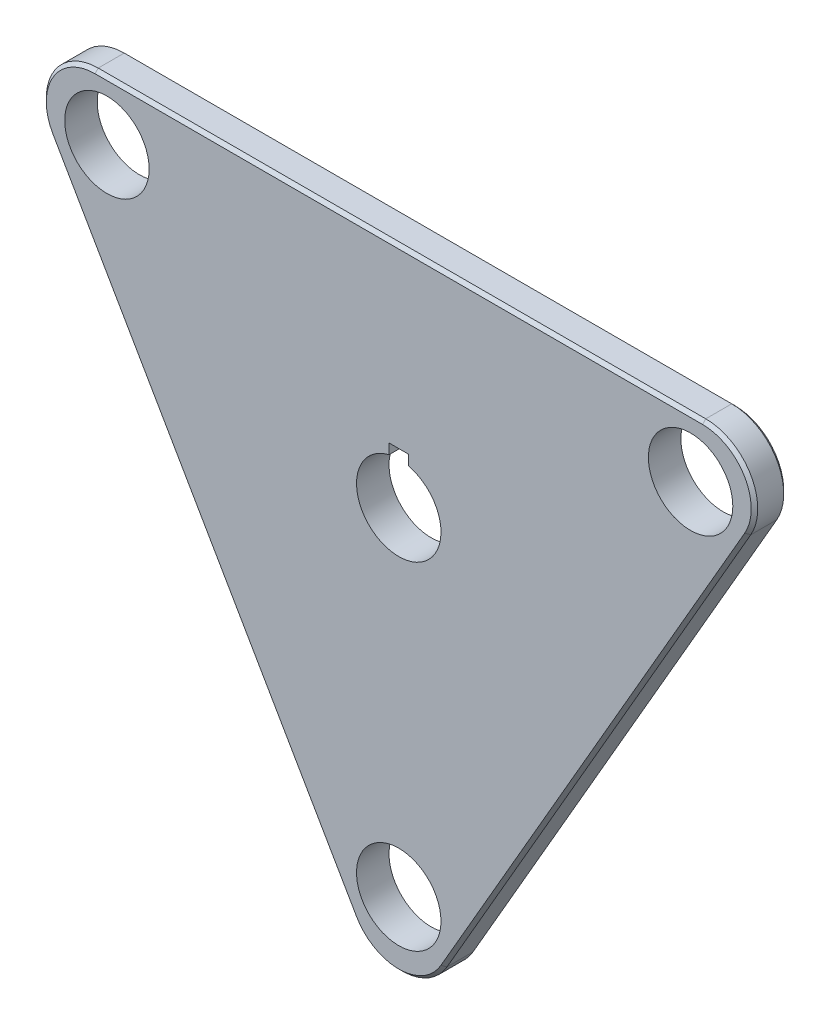
ISO-10303-21;
HEADER;
FILE_DESCRIPTION(('STEP AP214'),'2;1');
FILE_NAME('part.step','',(''),(''),'','','');
FILE_SCHEMA(('AUTOMOTIVE_DESIGN { 1 0 10303 214 1 1 1 1 }'));
ENDSEC;
DATA;
#1=APPLICATION_CONTEXT('core data for automotive mechanical design processes');
#2=APPLICATION_PROTOCOL_DEFINITION('international standard','automotive_design',2000,#1);
#3=PRODUCT_CONTEXT('',#1,'mechanical');
#4=PRODUCT('Part','Part','',(#3));
#5=PRODUCT_RELATED_PRODUCT_CATEGORY('part','',(#4));
#6=PRODUCT_DEFINITION_FORMATION('','',#4);
#7=PRODUCT_DEFINITION_CONTEXT('part definition',#1,'design');
#8=PRODUCT_DEFINITION('design','',#6,#7);
#9=PRODUCT_DEFINITION_SHAPE('','',#8);
#10=(LENGTH_UNIT() NAMED_UNIT(*) SI_UNIT(.MILLI.,.METRE.));
#11=(NAMED_UNIT(*) PLANE_ANGLE_UNIT() SI_UNIT($,.RADIAN.));
#12=(NAMED_UNIT(*) SI_UNIT($,.STERADIAN.) SOLID_ANGLE_UNIT());
#13=UNCERTAINTY_MEASURE_WITH_UNIT(LENGTH_MEASURE(1.E-05),#10,'distance_accuracy_value','');
#14=(GEOMETRIC_REPRESENTATION_CONTEXT(3) GLOBAL_UNCERTAINTY_ASSIGNED_CONTEXT((#13)) GLOBAL_UNIT_ASSIGNED_CONTEXT((#10,
#11,#12)) REPRESENTATION_CONTEXT('',''));
#15=CARTESIAN_POINT('',(0.,0.,0.));
#16=DIRECTION('',(0.,0.,1.));
#17=DIRECTION('',(1.,0.,0.));
#18=AXIS2_PLACEMENT_3D('',#15,#16,#17);
#19=CARTESIAN_POINT('',(-46.7653718043597,27.,-5.));
#20=DIRECTION('',(0.,0.,1.));
#21=DIRECTION('',(1.,0.,0.));
#22=AXIS2_PLACEMENT_3D('',#19,#20,#21);
#23=CYLINDRICAL_SURFACE('',#22,7.99999999999999);
#24=DIRECTION('',(0.,0.,1.));
#25=VECTOR('',#24,1.);
#26=CARTESIAN_POINT('',(-46.7653718043597,35.,-5.));
#27=LINE('',#26,#25);
#28=CARTESIAN_POINT('',(-46.7653718043597,35.,-4.5));
#29=VERTEX_POINT('',#28);
#30=CARTESIAN_POINT('',(-46.7653718043597,35.,-0.5));
#31=VERTEX_POINT('',#30);
#32=EDGE_CURVE('E206',#29,#31,#27,.T.);
#33=ORIENTED_EDGE('',*,*,#32,.F.);
#34=CARTESIAN_POINT('',(-46.7653718043597,27.,-4.5));
#35=DIRECTION('',(0.,0.,1.));
#36=DIRECTION('',(1.,0.,0.));
#37=AXIS2_PLACEMENT_3D('',#34,#35,#36);
#38=CIRCLE('',#37,7.99999999999999);
#39=CARTESIAN_POINT('',(-53.6935750346352,23.,-4.5));
#40=VERTEX_POINT('',#39);
#41=EDGE_CURVE('E287',#29,#40,#38,.T.);
#42=ORIENTED_EDGE('',*,*,#41,.T.);
#43=DIRECTION('',(0.,0.,1.));
#44=VECTOR('',#43,1.);
#45=CARTESIAN_POINT('',(-53.6935750346352,23.,-5.));
#46=LINE('',#45,#44);
#47=CARTESIAN_POINT('',(-53.6935750346352,23.,-0.5));
#48=VERTEX_POINT('',#47);
#49=EDGE_CURVE('E203',#40,#48,#46,.T.);
#50=ORIENTED_EDGE('',*,*,#49,.T.);
#51=CARTESIAN_POINT('',(-46.7653718043597,27.,-0.5));
#52=DIRECTION('',(0.,0.,1.));
#53=DIRECTION('',(1.,0.,0.));
#54=AXIS2_PLACEMENT_3D('',#51,#52,#53);
#55=CIRCLE('',#54,7.99999999999999);
#56=EDGE_CURVE('E242',#48,#31,#55,.F.);
#57=ORIENTED_EDGE('',*,*,#56,.T.);
#58=EDGE_LOOP('',(#33,#42,#50,#57));
#59=FACE_BOUND('',#58,.T.);
#60=ADVANCED_FACE('F35',(#59),#23,.T.);
#61=CARTESIAN_POINT('',(46.7653718043597,35.,-5.));
#62=DIRECTION('',(0.,1.,0.));
#63=DIRECTION('',(-1.,0.,0.));
#64=AXIS2_PLACEMENT_3D('',#61,#62,#63);
#65=PLANE('',#64);
#66=DIRECTION('',(0.,0.,1.));
#67=VECTOR('',#66,1.);
#68=CARTESIAN_POINT('',(46.7653718043597,35.,-5.));
#69=LINE('',#68,#67);
#70=CARTESIAN_POINT('',(46.7653718043597,35.,-4.5));
#71=VERTEX_POINT('',#70);
#72=CARTESIAN_POINT('',(46.7653718043597,35.,-0.5));
#73=VERTEX_POINT('',#72);
#74=EDGE_CURVE('E209',#71,#73,#69,.T.);
#75=ORIENTED_EDGE('',*,*,#74,.F.);
#76=DIRECTION('',(-1.,0.,0.));
#77=VECTOR('',#76,1.);
#78=CARTESIAN_POINT('',(-46.7653718043597,35.,-4.5));
#79=LINE('',#78,#77);
#80=EDGE_CURVE('E58',#71,#29,#79,.T.);
#81=ORIENTED_EDGE('',*,*,#80,.T.);
#82=ORIENTED_EDGE('',*,*,#32,.T.);
#83=DIRECTION('',(1.,0.,0.));
#84=VECTOR('',#83,1.);
#85=CARTESIAN_POINT('',(46.7653718043597,35.,-0.5));
#86=LINE('',#85,#84);
#87=EDGE_CURVE('E245',#31,#73,#86,.T.);
#88=ORIENTED_EDGE('',*,*,#87,.T.);
#89=EDGE_LOOP('',(#75,#81,#82,#88));
#90=FACE_BOUND('',#89,.T.);
#91=ADVANCED_FACE('F335',(#90),#65,.T.);
#92=CARTESIAN_POINT('',(46.7653718043597,27.,-5.));
#93=DIRECTION('',(0.,0.,1.));
#94=DIRECTION('',(1.,0.,0.));
#95=AXIS2_PLACEMENT_3D('',#92,#93,#94);
#96=CYLINDRICAL_SURFACE('',#95,8.);
#97=DIRECTION('',(0.,0.,1.));
#98=VECTOR('',#97,1.);
#99=CARTESIAN_POINT('',(53.6935750346352,23.,-5.));
#100=LINE('',#99,#98);
#101=CARTESIAN_POINT('',(53.6935750346352,23.,-4.5));
#102=VERTEX_POINT('',#101);
#103=CARTESIAN_POINT('',(53.6935750346352,23.,-0.5));
#104=VERTEX_POINT('',#103);
#105=EDGE_CURVE('E211',#102,#104,#100,.T.);
#106=ORIENTED_EDGE('',*,*,#105,.F.);
#107=CARTESIAN_POINT('',(46.7653718043597,27.,-4.5));
#108=DIRECTION('',(0.,0.,1.));
#109=DIRECTION('',(1.,0.,0.));
#110=AXIS2_PLACEMENT_3D('',#107,#108,#109);
#111=CIRCLE('',#110,8.);
#112=EDGE_CURVE('E285',#102,#71,#111,.T.);
#113=ORIENTED_EDGE('',*,*,#112,.T.);
#114=ORIENTED_EDGE('',*,*,#74,.T.);
#115=CARTESIAN_POINT('',(46.7653718043597,27.,-0.5));
#116=DIRECTION('',(0.,0.,1.));
#117=DIRECTION('',(1.,0.,0.));
#118=AXIS2_PLACEMENT_3D('',#115,#116,#117);
#119=CIRCLE('',#118,8.);
#120=EDGE_CURVE('E239',#73,#104,#119,.F.);
#121=ORIENTED_EDGE('',*,*,#120,.T.);
#122=EDGE_LOOP('',(#106,#113,#114,#121));
#123=FACE_BOUND('',#122,.T.);
#124=ADVANCED_FACE('F341',(#123),#96,.T.);
#125=CARTESIAN_POINT('',(6.92820323027551,-58.,-5.));
#126=DIRECTION('',(0.866025403784439,-0.5,0.));
#127=DIRECTION('',(0.5,0.866025403784439,0.));
#128=AXIS2_PLACEMENT_3D('',#125,#126,#127);
#129=PLANE('',#128);
#130=DIRECTION('',(0.,0.,1.));
#131=VECTOR('',#130,1.);
#132=CARTESIAN_POINT('',(6.92820323027551,-58.,-5.));
#133=LINE('',#132,#131);
#134=CARTESIAN_POINT('',(6.92820323027551,-58.,-4.49999999999999));
#135=VERTEX_POINT('',#134);
#136=CARTESIAN_POINT('',(6.92820323027551,-58.,-0.499999999999999));
#137=VERTEX_POINT('',#136);
#138=EDGE_CURVE('E213',#135,#137,#133,.T.);
#139=ORIENTED_EDGE('',*,*,#138,.F.);
#140=DIRECTION('',(0.5,0.866025403784439,0.));
#141=VECTOR('',#140,1.);
#142=CARTESIAN_POINT('',(53.6935750346352,23.,-4.49999999999999));
#143=LINE('',#142,#141);
#144=EDGE_CURVE('E281',#135,#102,#143,.T.);
#145=ORIENTED_EDGE('',*,*,#144,.T.);
#146=ORIENTED_EDGE('',*,*,#105,.T.);
#147=DIRECTION('',(-0.5,-0.866025403784439,0.));
#148=VECTOR('',#147,1.);
#149=CARTESIAN_POINT('',(6.92820323027551,-58.,-0.499999999999999));
#150=LINE('',#149,#148);
#151=EDGE_CURVE('E233',#104,#137,#150,.T.);
#152=ORIENTED_EDGE('',*,*,#151,.T.);
#153=EDGE_LOOP('',(#139,#145,#146,#152));
#154=FACE_BOUND('',#153,.T.);
#155=ADVANCED_FACE('F435',(#154),#129,.T.);
#156=CARTESIAN_POINT('',(0.,-54.,-5.));
#157=DIRECTION('',(0.,0.,1.));
#158=DIRECTION('',(1.,0.,0.));
#159=AXIS2_PLACEMENT_3D('',#156,#157,#158);
#160=CYLINDRICAL_SURFACE('',#159,8.);
#161=DIRECTION('',(0.,0.,1.));
#162=VECTOR('',#161,1.);
#163=CARTESIAN_POINT('',(-6.9282032302755,-58.,-5.));
#164=LINE('',#163,#162);
#165=CARTESIAN_POINT('',(-6.9282032302755,-58.,-4.5));
#166=VERTEX_POINT('',#165);
#167=CARTESIAN_POINT('',(-6.9282032302755,-58.,-0.5));
#168=VERTEX_POINT('',#167);
#169=EDGE_CURVE('E215',#166,#168,#164,.T.);
#170=ORIENTED_EDGE('',*,*,#169,.F.);
#171=CARTESIAN_POINT('',(0.,-54.,-4.5));
#172=DIRECTION('',(0.,0.,1.));
#173=DIRECTION('',(1.,0.,0.));
#174=AXIS2_PLACEMENT_3D('',#171,#172,#173);
#175=CIRCLE('',#174,8.);
#176=EDGE_CURVE('E248',#166,#135,#175,.T.);
#177=ORIENTED_EDGE('',*,*,#176,.T.);
#178=ORIENTED_EDGE('',*,*,#138,.T.);
#179=CARTESIAN_POINT('',(0.,-54.,-0.5));
#180=DIRECTION('',(0.,0.,1.));
#181=DIRECTION('',(1.,0.,0.));
#182=AXIS2_PLACEMENT_3D('',#179,#180,#181);
#183=CIRCLE('',#182,8.);
#184=EDGE_CURVE('E230',#137,#168,#183,.F.);
#185=ORIENTED_EDGE('',*,*,#184,.T.);
#186=EDGE_LOOP('',(#170,#177,#178,#185));
#187=FACE_BOUND('',#186,.T.);
#188=ADVANCED_FACE('F408',(#187),#160,.T.);
#189=CARTESIAN_POINT('',(-53.6935750346352,23.,-5.));
#190=DIRECTION('',(-0.866025403784439,-0.5,0.));
#191=DIRECTION('',(0.5,-0.866025403784439,0.));
#192=AXIS2_PLACEMENT_3D('',#189,#190,#191);
#193=PLANE('',#192);
#194=ORIENTED_EDGE('',*,*,#49,.F.);
#195=DIRECTION('',(0.5,-0.866025403784439,0.));
#196=VECTOR('',#195,1.);
#197=CARTESIAN_POINT('',(-6.92820323027551,-58.,-4.5));
#198=LINE('',#197,#196);
#199=EDGE_CURVE('E283',#40,#166,#198,.T.);
#200=ORIENTED_EDGE('',*,*,#199,.T.);
#201=ORIENTED_EDGE('',*,*,#169,.T.);
#202=DIRECTION('',(-0.5,0.866025403784439,0.));
#203=VECTOR('',#202,1.);
#204=CARTESIAN_POINT('',(-53.6935750346352,23.,-0.5));
#205=LINE('',#204,#203);
#206=EDGE_CURVE('E236',#168,#48,#205,.T.);
#207=ORIENTED_EDGE('',*,*,#206,.T.);
#208=EDGE_LOOP('',(#194,#200,#201,#207));
#209=FACE_BOUND('',#208,.T.);
#210=ADVANCED_FACE('F311',(#209),#193,.T.);
#211=CARTESIAN_POINT('',(-46.7653718043597,27.,-5.));
#212=DIRECTION('',(0.,0.,1.));
#213=DIRECTION('',(1.,0.,0.));
#214=AXIS2_PLACEMENT_3D('',#211,#212,#213);
#215=PLANE('',#214);
#216=CARTESIAN_POINT('',(0.,0.,-5.));
#217=DIRECTION('',(0.,0.,1.));
#218=DIRECTION('',(1.,0.,0.));
#219=AXIS2_PLACEMENT_3D('',#216,#217,#218);
#220=CIRCLE('',#219,6.5);
#221=CARTESIAN_POINT('',(-1.5,6.32455532033676,-5.));
#222=VERTEX_POINT('',#221);
#223=CARTESIAN_POINT('',(1.5,6.32455532033676,-5.));
#224=VERTEX_POINT('',#223);
#225=EDGE_CURVE('E181',#222,#224,#220,.T.);
#226=ORIENTED_EDGE('',*,*,#225,.T.);
#227=DIRECTION('',(0.,1.,0.));
#228=VECTOR('',#227,1.);
#229=CARTESIAN_POINT('',(1.5,27.,-5.));
#230=LINE('',#229,#228);
#231=CARTESIAN_POINT('',(1.5,7.9,-5.));
#232=VERTEX_POINT('',#231);
#233=EDGE_CURVE('E177',#224,#232,#230,.T.);
#234=ORIENTED_EDGE('',*,*,#233,.T.);
#235=DIRECTION('',(-1.,0.,0.));
#236=VECTOR('',#235,1.);
#237=CARTESIAN_POINT('',(-46.7653718043597,7.9,-5.));
#238=LINE('',#237,#236);
#239=CARTESIAN_POINT('',(-1.5,7.9,-5.));
#240=VERTEX_POINT('',#239);
#241=EDGE_CURVE('E156',#232,#240,#238,.T.);
#242=ORIENTED_EDGE('',*,*,#241,.T.);
#243=DIRECTION('',(0.,-1.,0.));
#244=VECTOR('',#243,1.);
#245=CARTESIAN_POINT('',(-1.5,27.,-5.));
#246=LINE('',#245,#244);
#247=EDGE_CURVE('E173',#240,#222,#246,.T.);
#248=ORIENTED_EDGE('',*,*,#247,.T.);
#249=EDGE_LOOP('',(#226,#234,#242,#248));
#250=FACE_BOUND('',#249,.T.);
#251=DIRECTION('',(-0.5,-0.866025403784439,0.));
#252=VECTOR('',#251,1.);
#253=CARTESIAN_POINT('',(6.4951905283833,-57.75,-5.));
#254=LINE('',#253,#252);
#255=CARTESIAN_POINT('',(53.260562332743,23.25,-5.));
#256=VERTEX_POINT('',#255);
#257=CARTESIAN_POINT('',(6.4951905283833,-57.75,-5.));
#258=VERTEX_POINT('',#257);
#259=EDGE_CURVE('E276',#256,#258,#254,.T.);
#260=ORIENTED_EDGE('',*,*,#259,.T.);
#261=CARTESIAN_POINT('',(0.,-54.,-5.));
#262=DIRECTION('',(0.,0.,1.));
#263=DIRECTION('',(1.,0.,0.));
#264=AXIS2_PLACEMENT_3D('',#261,#262,#263);
#265=CIRCLE('',#264,7.5);
#266=CARTESIAN_POINT('',(-6.49519052838328,-57.75,-5.));
#267=VERTEX_POINT('',#266);
#268=EDGE_CURVE('E278',#258,#267,#265,.F.);
#269=ORIENTED_EDGE('',*,*,#268,.T.);
#270=DIRECTION('',(-0.5,0.866025403784439,0.));
#271=VECTOR('',#270,1.);
#272=CARTESIAN_POINT('',(-53.260562332743,23.25,-5.));
#273=LINE('',#272,#271);
#274=CARTESIAN_POINT('',(-53.260562332743,23.25,-5.));
#275=VERTEX_POINT('',#274);
#276=EDGE_CURVE('E274',#267,#275,#273,.T.);
#277=ORIENTED_EDGE('',*,*,#276,.T.);
#278=CARTESIAN_POINT('',(-46.7653718043597,27.,-5.));
#279=DIRECTION('',(0.,0.,1.));
#280=DIRECTION('',(1.,0.,0.));
#281=AXIS2_PLACEMENT_3D('',#278,#279,#280);
#282=CIRCLE('',#281,7.49999999999999);
#283=CARTESIAN_POINT('',(-46.7653718043597,34.5,-5.));
#284=VERTEX_POINT('',#283);
#285=EDGE_CURVE('E270',#275,#284,#282,.F.);
#286=ORIENTED_EDGE('',*,*,#285,.T.);
#287=DIRECTION('',(1.,0.,0.));
#288=VECTOR('',#287,1.);
#289=CARTESIAN_POINT('',(46.7653718043597,34.5,-5.));
#290=LINE('',#289,#288);
#291=CARTESIAN_POINT('',(46.7653718043597,34.5,-5.));
#292=VERTEX_POINT('',#291);
#293=EDGE_CURVE('E268',#284,#292,#290,.T.);
#294=ORIENTED_EDGE('',*,*,#293,.T.);
#295=CARTESIAN_POINT('',(46.7653718043597,27.,-5.));
#296=DIRECTION('',(0.,0.,1.));
#297=DIRECTION('',(1.,0.,0.));
#298=AXIS2_PLACEMENT_3D('',#295,#296,#297);
#299=CIRCLE('',#298,7.5);
#300=EDGE_CURVE('E272',#292,#256,#299,.F.);
#301=ORIENTED_EDGE('',*,*,#300,.T.);
#302=EDGE_LOOP('',(#260,#269,#277,#286,#294,#301));
#303=FACE_BOUND('',#302,.T.);
#304=CARTESIAN_POINT('',(0.,-51.88,-5.));
#305=DIRECTION('',(0.,0.,1.));
#306=DIRECTION('',(1.,0.,0.));
#307=AXIS2_PLACEMENT_3D('',#304,#305,#306);
#308=CIRCLE('',#307,6.5);
#309=CARTESIAN_POINT('',(6.50000000000001,-51.88,-5.));
#310=VERTEX_POINT('',#309);
#311=EDGE_CURVE('E186',#310,#310,#308,.T.);
#312=ORIENTED_EDGE('',*,*,#311,.T.);
#313=EDGE_LOOP('',(#312));
#314=FACE_BOUND('',#313,.T.);
#315=CARTESIAN_POINT('',(44.9293979483367,25.94,-5.));
#316=DIRECTION('',(0.,0.,1.));
#317=DIRECTION('',(1.,0.,0.));
#318=AXIS2_PLACEMENT_3D('',#315,#316,#317);
#319=CIRCLE('',#318,6.5);
#320=CARTESIAN_POINT('',(51.4293979483367,25.94,-5.));
#321=VERTEX_POINT('',#320);
#322=EDGE_CURVE('E194',#321,#321,#319,.T.);
#323=ORIENTED_EDGE('',*,*,#322,.T.);
#324=EDGE_LOOP('',(#323));
#325=FACE_BOUND('',#324,.T.);
#326=CARTESIAN_POINT('',(-44.9293979483367,25.94,-5.));
#327=DIRECTION('',(0.,0.,1.));
#328=DIRECTION('',(1.,0.,0.));
#329=AXIS2_PLACEMENT_3D('',#326,#327,#328);
#330=CIRCLE('',#329,6.5);
#331=CARTESIAN_POINT('',(-38.4293979483367,25.94,-5.));
#332=VERTEX_POINT('',#331);
#333=EDGE_CURVE('E200',#332,#332,#330,.T.);
#334=ORIENTED_EDGE('',*,*,#333,.T.);
#335=EDGE_LOOP('',(#334));
#336=FACE_BOUND('',#335,.T.);
#337=ADVANCED_FACE('F308',(#250,#303,#314,#325,#336),#215,.F.);
#338=CARTESIAN_POINT('',(-46.7653718043597,27.,0.));
#339=DIRECTION('',(0.,0.,1.));
#340=DIRECTION('',(1.,0.,0.));
#341=AXIS2_PLACEMENT_3D('',#338,#339,#340);
#342=PLANE('',#341);
#343=DIRECTION('',(0.,1.,0.));
#344=VECTOR('',#343,1.);
#345=CARTESIAN_POINT('',(1.5,6.22481487243686,0.));
#346=LINE('',#345,#344);
#347=CARTESIAN_POINT('',(1.5,6.32455532033676,0.));
#348=VERTEX_POINT('',#347);
#349=CARTESIAN_POINT('',(1.5,7.9,0.));
#350=VERTEX_POINT('',#349);
#351=EDGE_CURVE('E160',#348,#350,#346,.T.);
#352=ORIENTED_EDGE('',*,*,#351,.F.);
#353=CARTESIAN_POINT('',(0.,0.,0.));
#354=DIRECTION('',(0.,0.,1.));
#355=DIRECTION('',(1.,0.,0.));
#356=AXIS2_PLACEMENT_3D('',#353,#354,#355);
#357=CIRCLE('',#356,6.5);
#358=CARTESIAN_POINT('',(-1.5,6.32455532033676,0.));
#359=VERTEX_POINT('',#358);
#360=EDGE_CURVE('E180',#359,#348,#357,.T.);
#361=ORIENTED_EDGE('',*,*,#360,.F.);
#362=DIRECTION('',(0.,-1.,0.));
#363=VECTOR('',#362,1.);
#364=CARTESIAN_POINT('',(-1.5,6.5,0.));
#365=LINE('',#364,#363);
#366=CARTESIAN_POINT('',(-1.5,7.9,0.));
#367=VERTEX_POINT('',#366);
#368=EDGE_CURVE('E50',#367,#359,#365,.T.);
#369=ORIENTED_EDGE('',*,*,#368,.F.);
#370=DIRECTION('',(-1.,0.,0.));
#371=VECTOR('',#370,1.);
#372=CARTESIAN_POINT('',(-1.5,7.9,0.));
#373=LINE('',#372,#371);
#374=EDGE_CURVE('E154',#350,#367,#373,.T.);
#375=ORIENTED_EDGE('',*,*,#374,.F.);
#376=EDGE_LOOP('',(#352,#361,#369,#375));
#377=FACE_BOUND('',#376,.T.);
#378=DIRECTION('',(0.5,-0.866025403784439,0.));
#379=VECTOR('',#378,1.);
#380=CARTESIAN_POINT('',(-53.260562332743,23.25,0.));
#381=LINE('',#380,#379);
#382=CARTESIAN_POINT('',(-53.260562332743,23.25,0.));
#383=VERTEX_POINT('',#382);
#384=CARTESIAN_POINT('',(-6.49519052838329,-57.75,0.));
#385=VERTEX_POINT('',#384);
#386=EDGE_CURVE('E223',#383,#385,#381,.T.);
#387=ORIENTED_EDGE('',*,*,#386,.T.);
#388=CARTESIAN_POINT('',(0.,-54.,0.));
#389=DIRECTION('',(0.,0.,1.));
#390=DIRECTION('',(1.,0.,0.));
#391=AXIS2_PLACEMENT_3D('',#388,#389,#390);
#392=CIRCLE('',#391,7.5);
#393=CARTESIAN_POINT('',(6.4951905283833,-57.75,0.));
#394=VERTEX_POINT('',#393);
#395=EDGE_CURVE('E227',#385,#394,#392,.T.);
#396=ORIENTED_EDGE('',*,*,#395,.T.);
#397=DIRECTION('',(0.5,0.866025403784439,0.));
#398=VECTOR('',#397,1.);
#399=CARTESIAN_POINT('',(29.8778764305632,-17.25,0.));
#400=LINE('',#399,#398);
#401=CARTESIAN_POINT('',(53.260562332743,23.25,0.));
#402=VERTEX_POINT('',#401);
#403=EDGE_CURVE('E225',#394,#402,#400,.T.);
#404=ORIENTED_EDGE('',*,*,#403,.T.);
#405=CARTESIAN_POINT('',(46.7653718043597,27.,0.));
#406=DIRECTION('',(0.,0.,1.));
#407=DIRECTION('',(1.,0.,0.));
#408=AXIS2_PLACEMENT_3D('',#405,#406,#407);
#409=CIRCLE('',#408,7.49999999999999);
#410=CARTESIAN_POINT('',(46.7653718043597,34.5,0.));
#411=VERTEX_POINT('',#410);
#412=EDGE_CURVE('E221',#402,#411,#409,.T.);
#413=ORIENTED_EDGE('',*,*,#412,.T.);
#414=DIRECTION('',(-1.,0.,0.));
#415=VECTOR('',#414,1.);
#416=CARTESIAN_POINT('',(-46.7653718043597,34.5,0.));
#417=LINE('',#416,#415);
#418=CARTESIAN_POINT('',(-46.7653718043597,34.5,0.));
#419=VERTEX_POINT('',#418);
#420=EDGE_CURVE('E208',#411,#419,#417,.T.);
#421=ORIENTED_EDGE('',*,*,#420,.T.);
#422=CARTESIAN_POINT('',(-46.7653718043597,27.,0.));
#423=DIRECTION('',(0.,0.,1.));
#424=DIRECTION('',(1.,0.,0.));
#425=AXIS2_PLACEMENT_3D('',#422,#423,#424);
#426=CIRCLE('',#425,7.49999999999999);
#427=EDGE_CURVE('E219',#419,#383,#426,.T.);
#428=ORIENTED_EDGE('',*,*,#427,.T.);
#429=EDGE_LOOP('',(#387,#396,#404,#413,#421,#428));
#430=FACE_BOUND('',#429,.T.);
#431=CARTESIAN_POINT('',(0.,-51.88,0.));
#432=DIRECTION('',(0.,0.,1.));
#433=DIRECTION('',(1.,0.,0.));
#434=AXIS2_PLACEMENT_3D('',#431,#432,#433);
#435=CIRCLE('',#434,6.5);
#436=CARTESIAN_POINT('',(6.50000000000001,-51.88,0.));
#437=VERTEX_POINT('',#436);
#438=EDGE_CURVE('E190',#437,#437,#435,.T.);
#439=ORIENTED_EDGE('',*,*,#438,.F.);
#440=EDGE_LOOP('',(#439));
#441=FACE_BOUND('',#440,.T.);
#442=CARTESIAN_POINT('',(44.9293979483367,25.94,0.));
#443=DIRECTION('',(0.,0.,1.));
#444=DIRECTION('',(1.,0.,0.));
#445=AXIS2_PLACEMENT_3D('',#442,#443,#444);
#446=CIRCLE('',#445,6.5);
#447=CARTESIAN_POINT('',(51.4293979483367,25.94,0.));
#448=VERTEX_POINT('',#447);
#449=EDGE_CURVE('E189',#448,#448,#446,.T.);
#450=ORIENTED_EDGE('',*,*,#449,.F.);
#451=EDGE_LOOP('',(#450));
#452=FACE_BOUND('',#451,.T.);
#453=CARTESIAN_POINT('',(-44.9293979483367,25.94,0.));
#454=DIRECTION('',(0.,0.,1.));
#455=DIRECTION('',(1.,0.,0.));
#456=AXIS2_PLACEMENT_3D('',#453,#454,#455);
#457=CIRCLE('',#456,6.5);
#458=CARTESIAN_POINT('',(-38.4293979483367,25.94,0.));
#459=VERTEX_POINT('',#458);
#460=EDGE_CURVE('E197',#459,#459,#457,.T.);
#461=ORIENTED_EDGE('',*,*,#460,.F.);
#462=EDGE_LOOP('',(#461));
#463=FACE_BOUND('',#462,.T.);
#464=ADVANCED_FACE('F168',(#377,#430,#441,#452,#463),#342,.T.);
#465=CARTESIAN_POINT('',(-44.9293979483367,25.94,-5.));
#466=DIRECTION('',(0.,0.,1.));
#467=DIRECTION('',(1.,0.,0.));
#468=AXIS2_PLACEMENT_3D('',#465,#466,#467);
#469=CYLINDRICAL_SURFACE('',#468,6.5);
#470=ORIENTED_EDGE('',*,*,#333,.F.);
#471=EDGE_LOOP('',(#470));
#472=FACE_BOUND('',#471,.T.);
#473=ORIENTED_EDGE('',*,*,#460,.T.);
#474=EDGE_LOOP('',(#473));
#475=FACE_BOUND('',#474,.T.);
#476=ADVANCED_FACE('F322',(#472,#475),#469,.F.);
#477=CARTESIAN_POINT('',(44.9293979483367,25.94,-5.));
#478=DIRECTION('',(0.,0.,1.));
#479=DIRECTION('',(1.,0.,0.));
#480=AXIS2_PLACEMENT_3D('',#477,#478,#479);
#481=CYLINDRICAL_SURFACE('',#480,6.5);
#482=ORIENTED_EDGE('',*,*,#322,.F.);
#483=EDGE_LOOP('',(#482));
#484=FACE_BOUND('',#483,.T.);
#485=ORIENTED_EDGE('',*,*,#449,.T.);
#486=EDGE_LOOP('',(#485));
#487=FACE_BOUND('',#486,.T.);
#488=ADVANCED_FACE('F325',(#484,#487),#481,.F.);
#489=CARTESIAN_POINT('',(0.,-51.88,-5.));
#490=DIRECTION('',(0.,0.,1.));
#491=DIRECTION('',(1.,0.,0.));
#492=AXIS2_PLACEMENT_3D('',#489,#490,#491);
#493=CYLINDRICAL_SURFACE('',#492,6.5);
#494=ORIENTED_EDGE('',*,*,#311,.F.);
#495=EDGE_LOOP('',(#494));
#496=FACE_BOUND('',#495,.T.);
#497=ORIENTED_EDGE('',*,*,#438,.T.);
#498=EDGE_LOOP('',(#497));
#499=FACE_BOUND('',#498,.T.);
#500=ADVANCED_FACE('F368',(#496,#499),#493,.F.);
#501=CARTESIAN_POINT('',(-46.7653718043597,34.5,0.));
#502=DIRECTION('',(0.,-0.707106781186547,-0.707106781186547));
#503=DIRECTION('',(-1.,0.,0.));
#504=AXIS2_PLACEMENT_3D('',#501,#502,#503);
#505=PLANE('',#504);
#506=DIRECTION('',(0.,-0.707106781186547,0.707106781186547));
#507=VECTOR('',#506,1.);
#508=CARTESIAN_POINT('',(46.7653718043597,35.,-0.5));
#509=LINE('',#508,#507);
#510=EDGE_CURVE('E261',#73,#411,#509,.T.);
#511=ORIENTED_EDGE('',*,*,#510,.F.);
#512=ORIENTED_EDGE('',*,*,#87,.F.);
#513=DIRECTION('',(0.,0.707106781186547,-0.707106781186547));
#514=VECTOR('',#513,1.);
#515=CARTESIAN_POINT('',(-46.7653718043597,34.5,0.));
#516=LINE('',#515,#514);
#517=EDGE_CURVE('E193',#419,#31,#516,.T.);
#518=ORIENTED_EDGE('',*,*,#517,.F.);
#519=ORIENTED_EDGE('',*,*,#420,.F.);
#520=EDGE_LOOP('',(#511,#512,#518,#519));
#521=FACE_BOUND('',#520,.T.);
#522=ADVANCED_FACE('F364',(#521),#505,.F.);
#523=CARTESIAN_POINT('',(-46.7653718043597,27.,0.));
#524=DIRECTION('',(0.,0.,-1.));
#525=DIRECTION('',(-1.,0.,0.));
#526=AXIS2_PLACEMENT_3D('',#523,#524,#525);
#527=CONICAL_SURFACE('',#526,7.49999999999999,0.785398163397448);
#528=ORIENTED_EDGE('',*,*,#517,.T.);
#529=ORIENTED_EDGE('',*,*,#56,.F.);
#530=DIRECTION('',(-0.612372435695796,-0.353553390593273,-0.707106781186546));
#531=VECTOR('',#530,1.);
#532=CARTESIAN_POINT('',(-53.260562332743,23.25,0.));
#533=LINE('',#532,#531);
#534=EDGE_CURVE('E258',#383,#48,#533,.T.);
#535=ORIENTED_EDGE('',*,*,#534,.F.);
#536=ORIENTED_EDGE('',*,*,#427,.F.);
#537=EDGE_LOOP('',(#528,#529,#535,#536));
#538=FACE_BOUND('',#537,.T.);
#539=ADVANCED_FACE('F360',(#538),#527,.T.);
#540=CARTESIAN_POINT('',(46.7653718043597,27.,0.));
#541=DIRECTION('',(0.,0.,-1.));
#542=DIRECTION('',(-1.,0.,0.));
#543=AXIS2_PLACEMENT_3D('',#540,#541,#542);
#544=CONICAL_SURFACE('',#543,7.49999999999999,0.78539816339745);
#545=ORIENTED_EDGE('',*,*,#510,.T.);
#546=ORIENTED_EDGE('',*,*,#412,.F.);
#547=DIRECTION('',(-0.612372435695795,0.353553390593278,0.707106781186545));
#548=VECTOR('',#547,1.);
#549=CARTESIAN_POINT('',(53.6935750346352,23.,-0.5));
#550=LINE('',#549,#548);
#551=EDGE_CURVE('E255',#104,#402,#550,.T.);
#552=ORIENTED_EDGE('',*,*,#551,.F.);
#553=ORIENTED_EDGE('',*,*,#120,.F.);
#554=EDGE_LOOP('',(#545,#546,#552,#553));
#555=FACE_BOUND('',#554,.T.);
#556=ADVANCED_FACE('F356',(#555),#544,.T.);
#557=CARTESIAN_POINT('',(-53.260562332743,23.25,0.));
#558=DIRECTION('',(0.612372435695793,0.353553390593273,-0.70710678118655));
#559=DIRECTION('',(0.5,-0.866025403784439,0.));
#560=AXIS2_PLACEMENT_3D('',#557,#558,#559);
#561=PLANE('',#560);
#562=ORIENTED_EDGE('',*,*,#534,.T.);
#563=ORIENTED_EDGE('',*,*,#206,.F.);
#564=DIRECTION('',(-0.612372435695794,-0.353553390593274,-0.707106781186547));
#565=VECTOR('',#564,1.);
#566=CARTESIAN_POINT('',(-6.49519052838329,-57.75,0.));
#567=LINE('',#566,#565);
#568=EDGE_CURVE('E251',#385,#168,#567,.T.);
#569=ORIENTED_EDGE('',*,*,#568,.F.);
#570=ORIENTED_EDGE('',*,*,#386,.F.);
#571=EDGE_LOOP('',(#562,#563,#569,#570));
#572=FACE_BOUND('',#571,.T.);
#573=ADVANCED_FACE('F352',(#572),#561,.F.);
#574=CARTESIAN_POINT('',(29.8778764305631,-17.25,0.));
#575=DIRECTION('',(-0.612372435695801,0.353553390593277,-0.70710678118654));
#576=DIRECTION('',(0.5,0.866025403784439,0.));
#577=AXIS2_PLACEMENT_3D('',#574,#575,#576);
#578=PLANE('',#577);
#579=ORIENTED_EDGE('',*,*,#551,.T.);
#580=ORIENTED_EDGE('',*,*,#403,.F.);
#581=DIRECTION('',(-0.612372435695788,0.353553390593277,0.707106781186551));
#582=VECTOR('',#581,1.);
#583=CARTESIAN_POINT('',(6.92820323027551,-58.,-0.499999999999999));
#584=LINE('',#583,#582);
#585=EDGE_CURVE('E249',#137,#394,#584,.T.);
#586=ORIENTED_EDGE('',*,*,#585,.F.);
#587=ORIENTED_EDGE('',*,*,#151,.F.);
#588=EDGE_LOOP('',(#579,#580,#586,#587));
#589=FACE_BOUND('',#588,.T.);
#590=ADVANCED_FACE('F348',(#589),#578,.F.);
#591=CARTESIAN_POINT('',(0.,-54.,0.));
#592=DIRECTION('',(0.,0.,-1.));
#593=DIRECTION('',(-1.,0.,0.));
#594=AXIS2_PLACEMENT_3D('',#591,#592,#593);
#595=CONICAL_SURFACE('',#594,7.5,0.785398163397448);
#596=ORIENTED_EDGE('',*,*,#568,.T.);
#597=ORIENTED_EDGE('',*,*,#184,.F.);
#598=ORIENTED_EDGE('',*,*,#585,.T.);
#599=ORIENTED_EDGE('',*,*,#395,.F.);
#600=EDGE_LOOP('',(#596,#597,#598,#599));
#601=FACE_BOUND('',#600,.T.);
#602=ADVANCED_FACE('F345',(#601),#595,.T.);
#603=CARTESIAN_POINT('',(46.7653718043597,35.,-4.5));
#604=DIRECTION('',(0.,0.707106781186547,-0.707106781186547));
#605=DIRECTION('',(1.,0.,0.));
#606=AXIS2_PLACEMENT_3D('',#603,#604,#605);
#607=PLANE('',#606);
#608=DIRECTION('',(0.,0.707106781186547,0.707106781186547));
#609=VECTOR('',#608,1.);
#610=CARTESIAN_POINT('',(46.7653718043597,34.5,-5.));
#611=LINE('',#610,#609);
#612=EDGE_CURVE('E299',#292,#71,#611,.T.);
#613=ORIENTED_EDGE('',*,*,#612,.F.);
#614=ORIENTED_EDGE('',*,*,#293,.F.);
#615=DIRECTION('',(0.,-0.707106781186547,-0.707106781186547));
#616=VECTOR('',#615,1.);
#617=CARTESIAN_POINT('',(-46.7653718043597,35.,-4.5));
#618=LINE('',#617,#616);
#619=EDGE_CURVE('E252',#29,#284,#618,.T.);
#620=ORIENTED_EDGE('',*,*,#619,.F.);
#621=ORIENTED_EDGE('',*,*,#80,.F.);
#622=EDGE_LOOP('',(#613,#614,#620,#621));
#623=FACE_BOUND('',#622,.T.);
#624=ADVANCED_FACE('F37',(#623),#607,.T.);
#625=CARTESIAN_POINT('',(-46.7653718043597,27.,-4.5));
#626=DIRECTION('',(0.,0.,1.));
#627=DIRECTION('',(1.,0.,0.));
#628=AXIS2_PLACEMENT_3D('',#625,#626,#627);
#629=CONICAL_SURFACE('',#628,7.99999999999999,0.785398163397448);
#630=ORIENTED_EDGE('',*,*,#619,.T.);
#631=ORIENTED_EDGE('',*,*,#285,.F.);
#632=DIRECTION('',(0.612372435695796,0.353553390593273,-0.707106781186546));
#633=VECTOR('',#632,1.);
#634=CARTESIAN_POINT('',(-53.6935750346352,23.,-4.5));
#635=LINE('',#634,#633);
#636=EDGE_CURVE('E296',#40,#275,#635,.T.);
#637=ORIENTED_EDGE('',*,*,#636,.F.);
#638=ORIENTED_EDGE('',*,*,#41,.F.);
#639=EDGE_LOOP('',(#630,#631,#637,#638));
#640=FACE_BOUND('',#639,.T.);
#641=ADVANCED_FACE('F384',(#640),#629,.T.);
#642=CARTESIAN_POINT('',(46.7653718043597,27.,-4.5));
#643=DIRECTION('',(0.,0.,1.));
#644=DIRECTION('',(1.,0.,0.));
#645=AXIS2_PLACEMENT_3D('',#642,#643,#644);
#646=CONICAL_SURFACE('',#645,8.,0.785398163397445);
#647=ORIENTED_EDGE('',*,*,#612,.T.);
#648=ORIENTED_EDGE('',*,*,#112,.F.);
#649=DIRECTION('',(0.61237243569579,-0.353553390593275,0.707106781186551));
#650=VECTOR('',#649,1.);
#651=CARTESIAN_POINT('',(53.260562332743,23.25,-5.));
#652=LINE('',#651,#650);
#653=EDGE_CURVE('E293',#256,#102,#652,.T.);
#654=ORIENTED_EDGE('',*,*,#653,.F.);
#655=ORIENTED_EDGE('',*,*,#300,.F.);
#656=EDGE_LOOP('',(#647,#648,#654,#655));
#657=FACE_BOUND('',#656,.T.);
#658=ADVANCED_FACE('F381',(#657),#646,.T.);
#659=CARTESIAN_POINT('',(-53.6935750346352,23.,-4.5));
#660=DIRECTION('',(-0.612372435695793,-0.353553390593273,-0.70710678118655));
#661=DIRECTION('',(-0.5,0.866025403784439,0.));
#662=AXIS2_PLACEMENT_3D('',#659,#660,#661);
#663=PLANE('',#662);
#664=ORIENTED_EDGE('',*,*,#636,.T.);
#665=ORIENTED_EDGE('',*,*,#276,.F.);
#666=DIRECTION('',(0.612372435695804,0.353553390593274,-0.70710678118654));
#667=VECTOR('',#666,1.);
#668=CARTESIAN_POINT('',(-6.92820323027551,-58.,-4.5));
#669=LINE('',#668,#667);
#670=EDGE_CURVE('E291',#166,#267,#669,.T.);
#671=ORIENTED_EDGE('',*,*,#670,.F.);
#672=ORIENTED_EDGE('',*,*,#199,.F.);
#673=EDGE_LOOP('',(#664,#665,#671,#672));
#674=FACE_BOUND('',#673,.T.);
#675=ADVANCED_FACE('F377',(#674),#663,.T.);
#676=CARTESIAN_POINT('',(6.92820323027551,-58.,-4.5));
#677=DIRECTION('',(0.612372435695801,-0.353553390593277,-0.70710678118654));
#678=DIRECTION('',(-0.5,-0.866025403784439,0.));
#679=AXIS2_PLACEMENT_3D('',#676,#677,#678);
#680=PLANE('',#679);
#681=ORIENTED_EDGE('',*,*,#653,.T.);
#682=ORIENTED_EDGE('',*,*,#144,.F.);
#683=DIRECTION('',(0.612372435695783,-0.353553390593265,0.707106781186561));
#684=VECTOR('',#683,1.);
#685=CARTESIAN_POINT('',(6.4951905283833,-57.75,-5.));
#686=LINE('',#685,#684);
#687=EDGE_CURVE('E184',#258,#135,#686,.T.);
#688=ORIENTED_EDGE('',*,*,#687,.F.);
#689=ORIENTED_EDGE('',*,*,#259,.F.);
#690=EDGE_LOOP('',(#681,#682,#688,#689));
#691=FACE_BOUND('',#690,.T.);
#692=ADVANCED_FACE('F373',(#691),#680,.T.);
#693=CARTESIAN_POINT('',(0.,-54.,-4.5));
#694=DIRECTION('',(0.,0.,1.));
#695=DIRECTION('',(1.,0.,0.));
#696=AXIS2_PLACEMENT_3D('',#693,#694,#695);
#697=CONICAL_SURFACE('',#696,8.,0.78539816339745);
#698=ORIENTED_EDGE('',*,*,#670,.T.);
#699=ORIENTED_EDGE('',*,*,#268,.F.);
#700=ORIENTED_EDGE('',*,*,#687,.T.);
#701=ORIENTED_EDGE('',*,*,#176,.F.);
#702=EDGE_LOOP('',(#698,#699,#700,#701));
#703=FACE_BOUND('',#702,.T.);
#704=ADVANCED_FACE('F370',(#703),#697,.T.);
#705=CARTESIAN_POINT('',(0.,0.,-5.));
#706=DIRECTION('',(0.,0.,1.));
#707=DIRECTION('',(1.,0.,0.));
#708=AXIS2_PLACEMENT_3D('',#705,#706,#707);
#709=CYLINDRICAL_SURFACE('',#708,6.5);
#710=ORIENTED_EDGE('',*,*,#360,.T.);
#711=DIRECTION('',(0.,0.,1.));
#712=VECTOR('',#711,1.);
#713=CARTESIAN_POINT('',(1.5,6.32455532033676,-5.));
#714=LINE('',#713,#712);
#715=EDGE_CURVE('E11',#348,#224,#714,.F.);
#716=ORIENTED_EDGE('',*,*,#715,.T.);
#717=ORIENTED_EDGE('',*,*,#225,.F.);
#718=DIRECTION('',(0.,0.,1.));
#719=VECTOR('',#718,1.);
#720=CARTESIAN_POINT('',(-1.5,6.32455532033676,-5.));
#721=LINE('',#720,#719);
#722=EDGE_CURVE('E43',#222,#359,#721,.T.);
#723=ORIENTED_EDGE('',*,*,#722,.T.);
#724=EDGE_LOOP('',(#710,#716,#717,#723));
#725=FACE_BOUND('',#724,.T.);
#726=ADVANCED_FACE('F305',(#725),#709,.F.);
#727=CARTESIAN_POINT('',(-1.5,7.9,-10.));
#728=DIRECTION('',(0.,1.,0.));
#729=DIRECTION('',(0.,0.,1.));
#730=AXIS2_PLACEMENT_3D('',#727,#728,#729);
#731=PLANE('',#730);
#732=DIRECTION('',(0.,0.,1.));
#733=VECTOR('',#732,1.);
#734=CARTESIAN_POINT('',(1.5,7.9,-10.));
#735=LINE('',#734,#733);
#736=EDGE_CURVE('E149',#232,#350,#735,.T.);
#737=ORIENTED_EDGE('',*,*,#736,.T.);
#738=ORIENTED_EDGE('',*,*,#374,.T.);
#739=DIRECTION('',(0.,0.,1.));
#740=VECTOR('',#739,1.);
#741=CARTESIAN_POINT('',(-1.5,7.9,-10.));
#742=LINE('',#741,#740);
#743=EDGE_CURVE('E159',#240,#367,#742,.T.);
#744=ORIENTED_EDGE('',*,*,#743,.F.);
#745=ORIENTED_EDGE('',*,*,#241,.F.);
#746=EDGE_LOOP('',(#737,#738,#744,#745));
#747=FACE_BOUND('',#746,.T.);
#748=ADVANCED_FACE('F151',(#747),#731,.F.);
#749=CARTESIAN_POINT('',(1.5,6.22481487243686,-10.));
#750=DIRECTION('',(1.,0.,0.));
#751=DIRECTION('',(0.,0.,-1.));
#752=AXIS2_PLACEMENT_3D('',#749,#750,#751);
#753=PLANE('',#752);
#754=ORIENTED_EDGE('',*,*,#715,.F.);
#755=ORIENTED_EDGE('',*,*,#351,.T.);
#756=ORIENTED_EDGE('',*,*,#736,.F.);
#757=ORIENTED_EDGE('',*,*,#233,.F.);
#758=EDGE_LOOP('',(#754,#755,#756,#757));
#759=FACE_BOUND('',#758,.T.);
#760=ADVANCED_FACE('F163',(#759),#753,.F.);
#761=CARTESIAN_POINT('',(-1.5,6.5,-10.));
#762=DIRECTION('',(-1.,0.,0.));
#763=DIRECTION('',(0.,0.,1.));
#764=AXIS2_PLACEMENT_3D('',#761,#762,#763);
#765=PLANE('',#764);
#766=ORIENTED_EDGE('',*,*,#743,.T.);
#767=ORIENTED_EDGE('',*,*,#368,.T.);
#768=ORIENTED_EDGE('',*,*,#722,.F.);
#769=ORIENTED_EDGE('',*,*,#247,.F.);
#770=EDGE_LOOP('',(#766,#767,#768,#769));
#771=FACE_BOUND('',#770,.T.);
#772=ADVANCED_FACE('F306',(#771),#765,.F.);
#773=CLOSED_SHELL('',(#60,#91,#124,#155,#188,#210,#337,#464,#476,#488,#500,#522,#539,#556,#573,
#590,#602,#624,#641,#658,#675,#692,#704,#726,#748,#760,#772));
#774=MANIFOLD_SOLID_BREP('B2',#773);
#775=ADVANCED_BREP_SHAPE_REPRESENTATION('',(#18,#774),#14);
#776=SHAPE_DEFINITION_REPRESENTATION(#9,#775);
ENDSEC;
END-ISO-10303-21;
